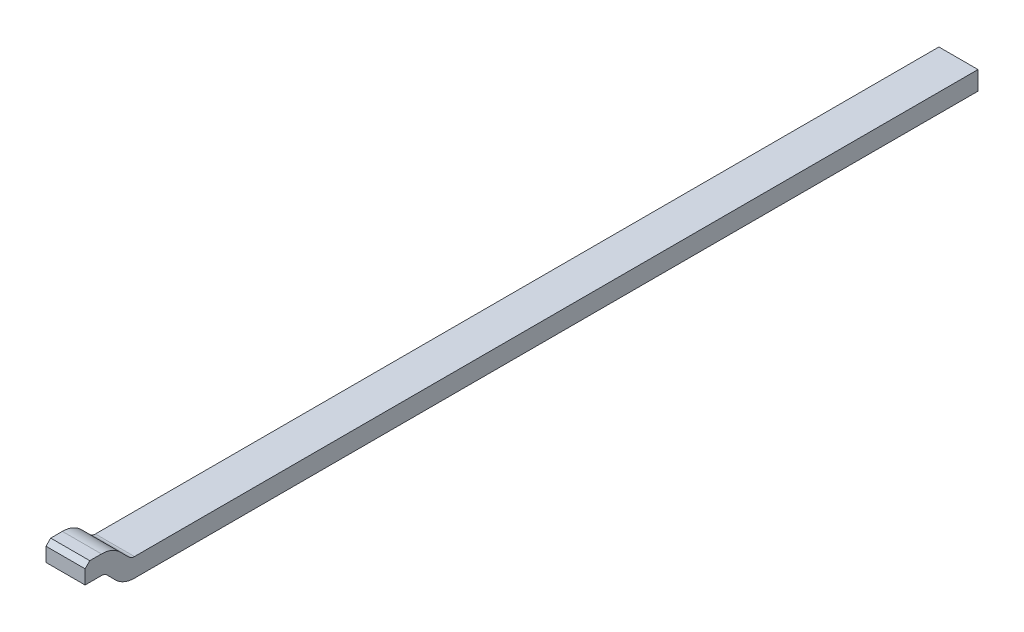
ISO-10303-21;
HEADER;
FILE_DESCRIPTION(('STEP AP214'),'2;1');
FILE_NAME('part.step','',(''),(''),'','','');
FILE_SCHEMA(('AUTOMOTIVE_DESIGN { 1 0 10303 214 1 1 1 1 }'));
ENDSEC;
DATA;
#1=APPLICATION_CONTEXT('core data for automotive mechanical design processes');
#2=APPLICATION_PROTOCOL_DEFINITION('international standard','automotive_design',2000,#1);
#3=PRODUCT_CONTEXT('',#1,'mechanical');
#4=PRODUCT('Part','Part','',(#3));
#5=PRODUCT_RELATED_PRODUCT_CATEGORY('part','',(#4));
#6=PRODUCT_DEFINITION_FORMATION('','',#4);
#7=PRODUCT_DEFINITION_CONTEXT('part definition',#1,'design');
#8=PRODUCT_DEFINITION('design','',#6,#7);
#9=PRODUCT_DEFINITION_SHAPE('','',#8);
#10=(LENGTH_UNIT() NAMED_UNIT(*) SI_UNIT(.MILLI.,.METRE.));
#11=(NAMED_UNIT(*) PLANE_ANGLE_UNIT() SI_UNIT($,.RADIAN.));
#12=(NAMED_UNIT(*) SI_UNIT($,.STERADIAN.) SOLID_ANGLE_UNIT());
#13=UNCERTAINTY_MEASURE_WITH_UNIT(LENGTH_MEASURE(1.E-05),#10,'distance_accuracy_value','');
#14=(GEOMETRIC_REPRESENTATION_CONTEXT(3) GLOBAL_UNCERTAINTY_ASSIGNED_CONTEXT((#13)) GLOBAL_UNIT_ASSIGNED_CONTEXT((#10,
#11,#12)) REPRESENTATION_CONTEXT('',''));
#15=CARTESIAN_POINT('',(0.,0.,0.));
#16=DIRECTION('',(0.,0.,1.));
#17=DIRECTION('',(1.,0.,0.));
#18=AXIS2_PLACEMENT_3D('',#15,#16,#17);
#19=CARTESIAN_POINT('',(15.66210822402,13.39951558355,-5.731698833076));
#20=DIRECTION('',(1.,0.,0.));
#21=DIRECTION('',(0.,0.,-1.));
#22=AXIS2_PLACEMENT_3D('',#19,#20,#21);
#23=PLANE('',#22);
#24=DIRECTION('',(0.,0.,-1.));
#25=VECTOR('',#24,1.);
#26=CARTESIAN_POINT('',(15.66210819433,12.93951558355,-11.38169883308));
#27=LINE('',#26,#25);
#28=CARTESIAN_POINT('',(15.6621081946751,12.93951558355,-5.77711513867901));
#29=VERTEX_POINT('',#28);
#30=CARTESIAN_POINT('',(15.6621082093583,12.93951558355,-11.17169883308));
#31=VERTEX_POINT('',#30);
#32=EDGE_CURVE('E28',#29,#31,#27,.T.);
#33=ORIENTED_EDGE('',*,*,#32,.T.);
#34=DIRECTION('',(0.,1.,0.));
#35=VECTOR('',#34,1.);
#36=CARTESIAN_POINT('',(15.66210822402,11.48941215274,-11.17169883308));
#37=LINE('',#36,#35);
#38=CARTESIAN_POINT('',(15.6621082093583,12.81951558355,-11.17169883308));
#39=VERTEX_POINT('',#38);
#40=EDGE_CURVE('E225',#39,#31,#37,.T.);
#41=ORIENTED_EDGE('',*,*,#40,.F.);
#42=DIRECTION('',(0.,0.,-1.));
#43=VECTOR('',#42,1.);
#44=CARTESIAN_POINT('',(15.66210819433,12.81951558355,-5.731698833076));
#45=LINE('',#44,#43);
#46=CARTESIAN_POINT('',(15.6621081946751,12.81951558355,-5.77711513867905));
#47=VERTEX_POINT('',#46);
#48=EDGE_CURVE('E163',#47,#39,#45,.T.);
#49=ORIENTED_EDGE('',*,*,#48,.F.);
#50=CARTESIAN_POINT('',(15.66210819433,12.98951558355,-5.777115138679));
#51=DIRECTION('',(1.,0.,0.));
#52=DIRECTION('',(0.,0.,1.));
#53=AXIS2_PLACEMENT_3D('',#50,#51,#52);
#54=CIRCLE('',#53,0.17);
#55=CARTESIAN_POINT('',(15.6621081946751,12.8693074307492,-5.65690698587737));
#56=VERTEX_POINT('',#55);
#57=EDGE_CURVE('E161',#56,#47,#54,.T.);
#58=ORIENTED_EDGE('',*,*,#57,.F.);
#59=DIRECTION('',(0.,-0.707106781180048,-0.707106781193047));
#60=VECTOR('',#59,1.);
#61=CARTESIAN_POINT('',(15.66210819433,12.92487092261,-5.601343494017));
#62=LINE('',#61,#60);
#63=CARTESIAN_POINT('',(15.6621081946751,12.9248709226098,-5.60134349401677));
#64=VERTEX_POINT('',#63);
#65=EDGE_CURVE('E148',#64,#56,#62,.T.);
#66=ORIENTED_EDGE('',*,*,#65,.F.);
#67=CARTESIAN_POINT('',(15.66210819433,12.88951558355,-5.565988154957));
#68=DIRECTION('',(-1.,0.,0.));
#69=DIRECTION('',(0.,0.,1.));
#70=AXIS2_PLACEMENT_3D('',#67,#68,#69);
#71=CIRCLE('',#70,0.05);
#72=CARTESIAN_POINT('',(15.6621081946751,12.93951558355,-5.565988154957));
#73=VERTEX_POINT('',#72);
#74=EDGE_CURVE('E197',#73,#64,#71,.T.);
#75=ORIENTED_EDGE('',*,*,#74,.F.);
#76=DIRECTION('',(0.,0.,-1.));
#77=VECTOR('',#76,1.);
#78=CARTESIAN_POINT('',(15.66210819433,12.93951558355,-5.731698833076));
#79=LINE('',#78,#77);
#80=CARTESIAN_POINT('',(15.6621081946751,12.93951558355,-5.461404460561));
#81=VERTEX_POINT('',#80);
#82=EDGE_CURVE('E183',#81,#73,#79,.T.);
#83=ORIENTED_EDGE('',*,*,#82,.F.);
#84=DIRECTION('',(0.,-1.,0.));
#85=VECTOR('',#84,1.);
#86=CARTESIAN_POINT('',(15.66210819433,12.93951558355,-5.461404460561));
#87=LINE('',#86,#85);
#88=CARTESIAN_POINT('',(15.6621081946751,13.02951558355,-5.461404460561));
#89=VERTEX_POINT('',#88);
#90=EDGE_CURVE('E230',#89,#81,#87,.T.);
#91=ORIENTED_EDGE('',*,*,#90,.F.);
#92=DIRECTION('',(0.,-0.707106781186548,0.707106781186548));
#93=VECTOR('',#92,1.);
#94=CARTESIAN_POINT('',(15.66210819433,13.05951558355,-5.491404460561));
#95=LINE('',#94,#93);
#96=CARTESIAN_POINT('',(15.6621081946751,13.05951558355,-5.491404460561));
#97=VERTEX_POINT('',#96);
#98=EDGE_CURVE('E198',#97,#89,#95,.T.);
#99=ORIENTED_EDGE('',*,*,#98,.F.);
#100=DIRECTION('',(0.,0.,1.));
#101=VECTOR('',#100,1.);
#102=CARTESIAN_POINT('',(15.66210819433,13.05951558355,-5.731698833076));
#103=LINE('',#102,#101);
#104=CARTESIAN_POINT('',(15.6621081946751,13.05951558355,-5.565988154957));
#105=VERTEX_POINT('',#104);
#106=EDGE_CURVE('E267',#105,#97,#103,.T.);
#107=ORIENTED_EDGE('',*,*,#106,.F.);
#108=CARTESIAN_POINT('',(15.66210819433,12.88951558355,-5.565988154957));
#109=DIRECTION('',(1.,0.,0.));
#110=DIRECTION('',(0.,0.,1.));
#111=AXIS2_PLACEMENT_3D('',#108,#109,#110);
#112=CIRCLE('',#111,0.17);
#113=CARTESIAN_POINT('',(15.6621081946751,13.0097237363508,-5.68619630775937));
#114=VERTEX_POINT('',#113);
#115=EDGE_CURVE('E108',#114,#105,#112,.T.);
#116=ORIENTED_EDGE('',*,*,#115,.F.);
#117=DIRECTION('',(0.,0.707106781180048,0.707106781193047));
#118=VECTOR('',#117,1.);
#119=CARTESIAN_POINT('',(15.66210819433,12.95416024449,-5.74175979962));
#120=LINE('',#119,#118);
#121=CARTESIAN_POINT('',(15.6621081946751,12.9541602444904,-5.74175979962039));
#122=VERTEX_POINT('',#121);
#123=EDGE_CURVE('E211',#122,#114,#120,.T.);
#124=ORIENTED_EDGE('',*,*,#123,.F.);
#125=CARTESIAN_POINT('',(15.66210819433,12.98951558355,-5.777115138679));
#126=DIRECTION('',(-1.,0.,0.));
#127=DIRECTION('',(0.,0.,1.));
#128=AXIS2_PLACEMENT_3D('',#125,#126,#127);
#129=CIRCLE('',#128,0.05);
#130=EDGE_CURVE('E188',#29,#122,#129,.T.);
#131=ORIENTED_EDGE('',*,*,#130,.F.);
#132=EDGE_LOOP('',(#33,#41,#49,#58,#66,#75,#83,#91,#99,#107,#116,#124,#131));
#133=FACE_BOUND('',#132,.T.);
#134=ADVANCED_FACE('F17',(#133),#23,.F.);
#135=CARTESIAN_POINT('',(15.91210822402,13.67951558355,-12.98169883308));
#136=DIRECTION('',(1.,0.,0.));
#137=DIRECTION('',(0.,0.,-1.));
#138=AXIS2_PLACEMENT_3D('',#135,#136,#137);
#139=PLANE('',#138);
#140=DIRECTION('',(0.,1.,0.));
#141=VECTOR('',#140,1.);
#142=CARTESIAN_POINT('',(15.91210822402,11.48941215274,-11.17169883308));
#143=LINE('',#142,#141);
#144=CARTESIAN_POINT('',(15.9121082093583,12.81951558355,-11.17169883308));
#145=VERTEX_POINT('',#144);
#146=CARTESIAN_POINT('',(15.9121082093583,12.93951558355,-11.17169883308));
#147=VERTEX_POINT('',#146);
#148=EDGE_CURVE('E239',#145,#147,#143,.T.);
#149=ORIENTED_EDGE('',*,*,#148,.T.);
#150=DIRECTION('',(0.,0.,1.));
#151=VECTOR('',#150,1.);
#152=CARTESIAN_POINT('',(15.91210819433,12.93951558355,-12.98169883308));
#153=LINE('',#152,#151);
#154=CARTESIAN_POINT('',(15.9121081866092,12.93951558355,-5.77711513867901));
#155=VERTEX_POINT('',#154);
#156=EDGE_CURVE('E11',#147,#155,#153,.T.);
#157=ORIENTED_EDGE('',*,*,#156,.T.);
#158=CARTESIAN_POINT('',(15.91210817799,12.98951558355,-5.777115138679));
#159=DIRECTION('',(-1.,0.,0.));
#160=DIRECTION('',(0.,0.,1.));
#161=AXIS2_PLACEMENT_3D('',#158,#159,#160);
#162=CIRCLE('',#161,0.05);
#163=CARTESIAN_POINT('',(15.9121081866092,12.9541602444904,-5.74175979962039));
#164=VERTEX_POINT('',#163);
#165=EDGE_CURVE('E191',#155,#164,#162,.T.);
#166=ORIENTED_EDGE('',*,*,#165,.T.);
#167=DIRECTION('',(0.,0.707106781180048,0.707106781193047));
#168=VECTOR('',#167,1.);
#169=CARTESIAN_POINT('',(15.91210819433,12.95416024449,-5.74175979962));
#170=LINE('',#169,#168);
#171=CARTESIAN_POINT('',(15.9121081946751,13.0097237363508,-5.68619630775937));
#172=VERTEX_POINT('',#171);
#173=EDGE_CURVE('E182',#164,#172,#170,.T.);
#174=ORIENTED_EDGE('',*,*,#173,.T.);
#175=CARTESIAN_POINT('',(15.91210819433,12.88951558355,-5.565988154957));
#176=DIRECTION('',(1.,0.,0.));
#177=DIRECTION('',(0.,0.,1.));
#178=AXIS2_PLACEMENT_3D('',#175,#176,#177);
#179=CIRCLE('',#178,0.17);
#180=CARTESIAN_POINT('',(15.9121081946751,13.05951558355,-5.565988154957));
#181=VERTEX_POINT('',#180);
#182=EDGE_CURVE('E95',#172,#181,#179,.T.);
#183=ORIENTED_EDGE('',*,*,#182,.T.);
#184=DIRECTION('',(0.,0.,1.));
#185=VECTOR('',#184,1.);
#186=CARTESIAN_POINT('',(15.91210819433,13.05951558355,-12.98169883308));
#187=LINE('',#186,#185);
#188=CARTESIAN_POINT('',(15.9121081946751,13.05951558355,-5.491404460561));
#189=VERTEX_POINT('',#188);
#190=EDGE_CURVE('E207',#181,#189,#187,.T.);
#191=ORIENTED_EDGE('',*,*,#190,.T.);
#192=DIRECTION('',(0.,-0.707106781186548,0.707106781186548));
#193=VECTOR('',#192,1.);
#194=CARTESIAN_POINT('',(15.91210819433,13.05951558355,-5.491404460561));
#195=LINE('',#194,#193);
#196=CARTESIAN_POINT('',(15.9121081946751,13.02951558355,-5.461404460561));
#197=VERTEX_POINT('',#196);
#198=EDGE_CURVE('E234',#189,#197,#195,.T.);
#199=ORIENTED_EDGE('',*,*,#198,.T.);
#200=DIRECTION('',(0.,-1.,0.));
#201=VECTOR('',#200,1.);
#202=CARTESIAN_POINT('',(15.91210819433,12.65951558355,-5.461404460561));
#203=LINE('',#202,#201);
#204=CARTESIAN_POINT('',(15.9121081946751,12.93951558355,-5.461404460561));
#205=VERTEX_POINT('',#204);
#206=EDGE_CURVE('E186',#197,#205,#203,.T.);
#207=ORIENTED_EDGE('',*,*,#206,.T.);
#208=DIRECTION('',(0.,0.,-1.));
#209=VECTOR('',#208,1.);
#210=CARTESIAN_POINT('',(15.91210819433,12.93951558355,-12.98169883308));
#211=LINE('',#210,#209);
#212=CARTESIAN_POINT('',(15.9121081946751,12.93951558355,-5.565988154957));
#213=VERTEX_POINT('',#212);
#214=EDGE_CURVE('E212',#205,#213,#211,.T.);
#215=ORIENTED_EDGE('',*,*,#214,.T.);
#216=CARTESIAN_POINT('',(15.91210819433,12.88951558355,-5.565988154957));
#217=DIRECTION('',(-1.,0.,0.));
#218=DIRECTION('',(0.,0.,1.));
#219=AXIS2_PLACEMENT_3D('',#216,#217,#218);
#220=CIRCLE('',#219,0.05);
#221=CARTESIAN_POINT('',(15.9121081946751,12.9248709226098,-5.60134349401678));
#222=VERTEX_POINT('',#221);
#223=EDGE_CURVE('E215',#213,#222,#220,.T.);
#224=ORIENTED_EDGE('',*,*,#223,.T.);
#225=DIRECTION('',(0.,-0.707106781180048,-0.707106781193047));
#226=VECTOR('',#225,1.);
#227=CARTESIAN_POINT('',(15.91210819433,12.92487092261,-5.601343494017));
#228=LINE('',#227,#226);
#229=CARTESIAN_POINT('',(15.9121081946751,12.8693074307492,-5.65690698587737));
#230=VERTEX_POINT('',#229);
#231=EDGE_CURVE('E158',#222,#230,#228,.T.);
#232=ORIENTED_EDGE('',*,*,#231,.T.);
#233=CARTESIAN_POINT('',(15.91210819433,12.98951558355,-5.777115138679));
#234=DIRECTION('',(1.,0.,0.));
#235=DIRECTION('',(0.,0.,1.));
#236=AXIS2_PLACEMENT_3D('',#233,#234,#235);
#237=CIRCLE('',#236,0.17);
#238=CARTESIAN_POINT('',(15.9121081946751,12.81951558355,-5.77711513867905));
#239=VERTEX_POINT('',#238);
#240=EDGE_CURVE('E171',#230,#239,#237,.T.);
#241=ORIENTED_EDGE('',*,*,#240,.T.);
#242=DIRECTION('',(0.,0.,-1.));
#243=VECTOR('',#242,1.);
#244=CARTESIAN_POINT('',(15.91210819433,12.81951558355,-12.98169883308));
#245=LINE('',#244,#243);
#246=EDGE_CURVE('E240',#239,#145,#245,.T.);
#247=ORIENTED_EDGE('',*,*,#246,.T.);
#248=EDGE_LOOP('',(#149,#157,#166,#174,#183,#191,#199,#207,#215,#224,#232,#241,#247));
#249=FACE_BOUND('',#248,.T.);
#250=ADVANCED_FACE('F314',(#249),#139,.T.);
#251=CARTESIAN_POINT('',(12.51210817501,12.93951558355,-11.38169883308));
#252=DIRECTION('',(0.,-1.,0.));
#253=DIRECTION('',(0.,0.,-1.));
#254=AXIS2_PLACEMENT_3D('',#251,#252,#253);
#255=PLANE('',#254);
#256=ORIENTED_EDGE('',*,*,#32,.F.);
#257=DIRECTION('',(-1.,0.,0.));
#258=VECTOR('',#257,1.);
#259=CARTESIAN_POINT('',(12.51210817501,12.93951558355,-5.777115138679));
#260=LINE('',#259,#258);
#261=EDGE_CURVE('E192',#155,#29,#260,.T.);
#262=ORIENTED_EDGE('',*,*,#261,.F.);
#263=ORIENTED_EDGE('',*,*,#156,.F.);
#264=DIRECTION('',(-1.,0.,0.));
#265=VECTOR('',#264,1.);
#266=CARTESIAN_POINT('',(13.11210817501,12.93951558355,-11.17169883308));
#267=LINE('',#266,#265);
#268=EDGE_CURVE('E235',#147,#31,#267,.T.);
#269=ORIENTED_EDGE('',*,*,#268,.T.);
#270=EDGE_LOOP('',(#256,#262,#263,#269));
#271=FACE_BOUND('',#270,.T.);
#272=ADVANCED_FACE('F320',(#271),#255,.F.);
#273=CARTESIAN_POINT('',(13.11210817501,5.079903349409,-11.17169883308));
#274=DIRECTION('',(0.,0.,-1.));
#275=DIRECTION('',(-1.,0.,0.));
#276=AXIS2_PLACEMENT_3D('',#273,#274,#275);
#277=PLANE('',#276);
#278=ORIENTED_EDGE('',*,*,#268,.F.);
#279=ORIENTED_EDGE('',*,*,#148,.F.);
#280=DIRECTION('',(-1.,0.,0.));
#281=VECTOR('',#280,1.);
#282=CARTESIAN_POINT('',(13.11210817501,12.81951558355,-11.17169883308));
#283=LINE('',#282,#281);
#284=EDGE_CURVE('E222',#145,#39,#283,.T.);
#285=ORIENTED_EDGE('',*,*,#284,.T.);
#286=ORIENTED_EDGE('',*,*,#40,.T.);
#287=EDGE_LOOP('',(#278,#279,#285,#286));
#288=FACE_BOUND('',#287,.T.);
#289=ADVANCED_FACE('F322',(#288),#277,.T.);
#290=CARTESIAN_POINT('',(0.,12.81951558355,0.));
#291=DIRECTION('',(0.,-1.,0.));
#292=DIRECTION('',(0.,0.,-1.));
#293=AXIS2_PLACEMENT_3D('',#290,#291,#292);
#294=PLANE('',#293);
#295=ORIENTED_EDGE('',*,*,#48,.T.);
#296=ORIENTED_EDGE('',*,*,#284,.F.);
#297=ORIENTED_EDGE('',*,*,#246,.F.);
#298=DIRECTION('',(-1.,0.,0.));
#299=VECTOR('',#298,1.);
#300=CARTESIAN_POINT('',(0.,12.81951558355,-5.777115138679));
#301=LINE('',#300,#299);
#302=EDGE_CURVE('E178',#239,#47,#301,.T.);
#303=ORIENTED_EDGE('',*,*,#302,.T.);
#304=EDGE_LOOP('',(#295,#296,#297,#303));
#305=FACE_BOUND('',#304,.T.);
#306=ADVANCED_FACE('F346',(#305),#294,.T.);
#307=CARTESIAN_POINT('',(12.51210817501,12.98951558355,-5.777115138679));
#308=DIRECTION('',(1.,0.,0.));
#309=DIRECTION('',(0.,0.,1.));
#310=AXIS2_PLACEMENT_3D('',#307,#308,#309);
#311=CYLINDRICAL_SURFACE('',#310,0.05);
#312=ORIENTED_EDGE('',*,*,#261,.T.);
#313=ORIENTED_EDGE('',*,*,#130,.T.);
#314=DIRECTION('',(-1.,0.,0.));
#315=VECTOR('',#314,1.);
#316=CARTESIAN_POINT('',(16.91210820408,12.954160244491,-5.741759799621));
#317=LINE('',#316,#315);
#318=EDGE_CURVE('E268',#164,#122,#317,.T.);
#319=ORIENTED_EDGE('',*,*,#318,.F.);
#320=ORIENTED_EDGE('',*,*,#165,.F.);
#321=EDGE_LOOP('',(#312,#313,#319,#320));
#322=FACE_BOUND('',#321,.T.);
#323=ADVANCED_FACE('F309',(#322),#311,.F.);
#324=CARTESIAN_POINT('',(16.91210820408,12.93951558355,-5.756404460561));
#325=DIRECTION('',(0.,0.707106781186548,-0.707106781186548));
#326=DIRECTION('',(-1.,0.,0.));
#327=AXIS2_PLACEMENT_3D('',#324,#325,#326);
#328=PLANE('',#327);
#329=DIRECTION('',(-1.,0.,0.));
#330=VECTOR('',#329,1.);
#331=CARTESIAN_POINT('',(16.91210820408,13.009723736351,-5.68619630776));
#332=LINE('',#331,#330);
#333=EDGE_CURVE('E206',#172,#114,#332,.T.);
#334=ORIENTED_EDGE('',*,*,#333,.F.);
#335=ORIENTED_EDGE('',*,*,#173,.F.);
#336=ORIENTED_EDGE('',*,*,#318,.T.);
#337=ORIENTED_EDGE('',*,*,#123,.T.);
#338=EDGE_LOOP('',(#334,#335,#336,#337));
#339=FACE_BOUND('',#338,.T.);
#340=ADVANCED_FACE('F296',(#339),#328,.T.);
#341=CARTESIAN_POINT('',(16.91210820408,12.88951558355,-5.565988154957));
#342=DIRECTION('',(1.,0.,0.));
#343=DIRECTION('',(0.,0.,1.));
#344=AXIS2_PLACEMENT_3D('',#341,#342,#343);
#345=CYLINDRICAL_SURFACE('',#344,0.17);
#346=DIRECTION('',(-1.,0.,0.));
#347=VECTOR('',#346,1.);
#348=CARTESIAN_POINT('',(16.91210820408,13.05951558355,-5.565988154957));
#349=LINE('',#348,#347);
#350=EDGE_CURVE('E202',#181,#105,#349,.T.);
#351=ORIENTED_EDGE('',*,*,#350,.F.);
#352=ORIENTED_EDGE('',*,*,#182,.F.);
#353=ORIENTED_EDGE('',*,*,#333,.T.);
#354=ORIENTED_EDGE('',*,*,#115,.T.);
#355=EDGE_LOOP('',(#351,#352,#353,#354));
#356=FACE_BOUND('',#355,.T.);
#357=ADVANCED_FACE('F299',(#356),#345,.T.);
#358=CARTESIAN_POINT('',(16.91210820408,13.05951558355,-5.661404460561));
#359=DIRECTION('',(0.,1.,0.));
#360=DIRECTION('',(1.,0.,0.));
#361=AXIS2_PLACEMENT_3D('',#358,#359,#360);
#362=PLANE('',#361);
#363=ORIENTED_EDGE('',*,*,#350,.T.);
#364=ORIENTED_EDGE('',*,*,#106,.T.);
#365=DIRECTION('',(1.,0.,0.));
#366=VECTOR('',#365,1.);
#367=CARTESIAN_POINT('',(16.91210820408,13.05951558355,-5.491404460561));
#368=LINE('',#367,#366);
#369=EDGE_CURVE('E203',#97,#189,#368,.T.);
#370=ORIENTED_EDGE('',*,*,#369,.T.);
#371=ORIENTED_EDGE('',*,*,#190,.F.);
#372=EDGE_LOOP('',(#363,#364,#370,#371));
#373=FACE_BOUND('',#372,.T.);
#374=ADVANCED_FACE('F19',(#373),#362,.T.);
#375=CARTESIAN_POINT('',(16.91210820408,13.05951558355,-5.491404460561));
#376=DIRECTION('',(0.,-0.707106781186048,-0.707106781187048));
#377=DIRECTION('',(0.,-0.707106781187048,0.707106781186048));
#378=AXIS2_PLACEMENT_3D('',#375,#376,#377);
#379=PLANE('',#378);
#380=DIRECTION('',(-1.,0.,0.));
#381=VECTOR('',#380,1.);
#382=CARTESIAN_POINT('',(16.91210820408,13.02951558355,-5.461404460561));
#383=LINE('',#382,#381);
#384=EDGE_CURVE('E226',#197,#89,#383,.T.);
#385=ORIENTED_EDGE('',*,*,#384,.F.);
#386=ORIENTED_EDGE('',*,*,#198,.F.);
#387=ORIENTED_EDGE('',*,*,#369,.F.);
#388=ORIENTED_EDGE('',*,*,#98,.T.);
#389=EDGE_LOOP('',(#385,#386,#387,#388));
#390=FACE_BOUND('',#389,.T.);
#391=ADVANCED_FACE('F308',(#390),#379,.F.);
#392=CARTESIAN_POINT('',(16.91210820408,13.05951558355,-5.461404460561));
#393=DIRECTION('',(0.,0.,1.));
#394=DIRECTION('',(1.,0.,0.));
#395=AXIS2_PLACEMENT_3D('',#392,#393,#394);
#396=PLANE('',#395);
#397=DIRECTION('',(1.,0.,0.));
#398=VECTOR('',#397,1.);
#399=CARTESIAN_POINT('',(17.5653424523,12.93951558355,-5.461404460561));
#400=LINE('',#399,#398);
#401=EDGE_CURVE('E187',#81,#205,#400,.T.);
#402=ORIENTED_EDGE('',*,*,#401,.T.);
#403=ORIENTED_EDGE('',*,*,#206,.F.);
#404=ORIENTED_EDGE('',*,*,#384,.T.);
#405=ORIENTED_EDGE('',*,*,#90,.T.);
#406=EDGE_LOOP('',(#402,#403,#404,#405));
#407=FACE_BOUND('',#406,.T.);
#408=ADVANCED_FACE('F338',(#407),#396,.T.);
#409=CARTESIAN_POINT('',(17.5653424523,12.93951558355,-5.535988154957));
#410=DIRECTION('',(0.,1.,-1.444831928366E-13));
#411=DIRECTION('',(0.,-1.444831928366E-13,-1.));
#412=AXIS2_PLACEMENT_3D('',#409,#410,#411);
#413=PLANE('',#412);
#414=ORIENTED_EDGE('',*,*,#214,.F.);
#415=ORIENTED_EDGE('',*,*,#401,.F.);
#416=ORIENTED_EDGE('',*,*,#82,.T.);
#417=DIRECTION('',(1.,0.,0.));
#418=VECTOR('',#417,1.);
#419=CARTESIAN_POINT('',(16.91210820408,12.93951558355,-5.565988154957));
#420=LINE('',#419,#418);
#421=EDGE_CURVE('E193',#73,#213,#420,.T.);
#422=ORIENTED_EDGE('',*,*,#421,.T.);
#423=EDGE_LOOP('',(#414,#415,#416,#422));
#424=FACE_BOUND('',#423,.T.);
#425=ADVANCED_FACE('F335',(#424),#413,.F.);
#426=CARTESIAN_POINT('',(16.91210820408,12.88951558355,-5.565988154957));
#427=DIRECTION('',(1.,0.,0.));
#428=DIRECTION('',(0.,0.,1.));
#429=AXIS2_PLACEMENT_3D('',#426,#427,#428);
#430=CYLINDRICAL_SURFACE('',#429,0.05);
#431=ORIENTED_EDGE('',*,*,#421,.F.);
#432=ORIENTED_EDGE('',*,*,#74,.T.);
#433=DIRECTION('',(-1.,0.,0.));
#434=VECTOR('',#433,1.);
#435=CARTESIAN_POINT('',(16.91210820408,12.92487092261,-5.601343494017));
#436=LINE('',#435,#434);
#437=EDGE_CURVE('E21',#222,#64,#436,.T.);
#438=ORIENTED_EDGE('',*,*,#437,.F.);
#439=ORIENTED_EDGE('',*,*,#223,.F.);
#440=EDGE_LOOP('',(#431,#432,#438,#439));
#441=FACE_BOUND('',#440,.T.);
#442=ADVANCED_FACE('F329',(#441),#430,.F.);
#443=CARTESIAN_POINT('',(16.91210820408,12.93951558355,-5.586698833076));
#444=DIRECTION('',(0.,-0.707106781186048,0.707106781187048));
#445=DIRECTION('',(-1.,0.,0.));
#446=AXIS2_PLACEMENT_3D('',#443,#444,#445);
#447=PLANE('',#446);
#448=ORIENTED_EDGE('',*,*,#437,.T.);
#449=ORIENTED_EDGE('',*,*,#65,.T.);
#450=DIRECTION('',(-1.,0.,0.));
#451=VECTOR('',#450,1.);
#452=CARTESIAN_POINT('',(13.06210817501,12.869307430749,-5.656906985877));
#453=LINE('',#452,#451);
#454=EDGE_CURVE('E153',#230,#56,#453,.T.);
#455=ORIENTED_EDGE('',*,*,#454,.F.);
#456=ORIENTED_EDGE('',*,*,#231,.F.);
#457=EDGE_LOOP('',(#448,#449,#455,#456));
#458=FACE_BOUND('',#457,.T.);
#459=ADVANCED_FACE('F150',(#458),#447,.T.);
#460=CARTESIAN_POINT('',(13.06210817501,12.98951558355,-5.777115138679));
#461=DIRECTION('',(1.,0.,0.));
#462=DIRECTION('',(0.,0.,1.));
#463=AXIS2_PLACEMENT_3D('',#460,#461,#462);
#464=CYLINDRICAL_SURFACE('',#463,0.17);
#465=ORIENTED_EDGE('',*,*,#302,.F.);
#466=ORIENTED_EDGE('',*,*,#240,.F.);
#467=ORIENTED_EDGE('',*,*,#454,.T.);
#468=ORIENTED_EDGE('',*,*,#57,.T.);
#469=EDGE_LOOP('',(#465,#466,#467,#468));
#470=FACE_BOUND('',#469,.T.);
#471=ADVANCED_FACE('F169',(#470),#464,.T.);
#472=CLOSED_SHELL('',(#134,#250,#272,#289,#306,#323,#340,#357,#374,#391,#408,#425,#442,#459,#471));
#473=MANIFOLD_SOLID_BREP('B1',#472);
#474=ADVANCED_BREP_SHAPE_REPRESENTATION('',(#18,#473),#14);
#475=SHAPE_DEFINITION_REPRESENTATION(#9,#474);
ENDSEC;
END-ISO-10303-21;
